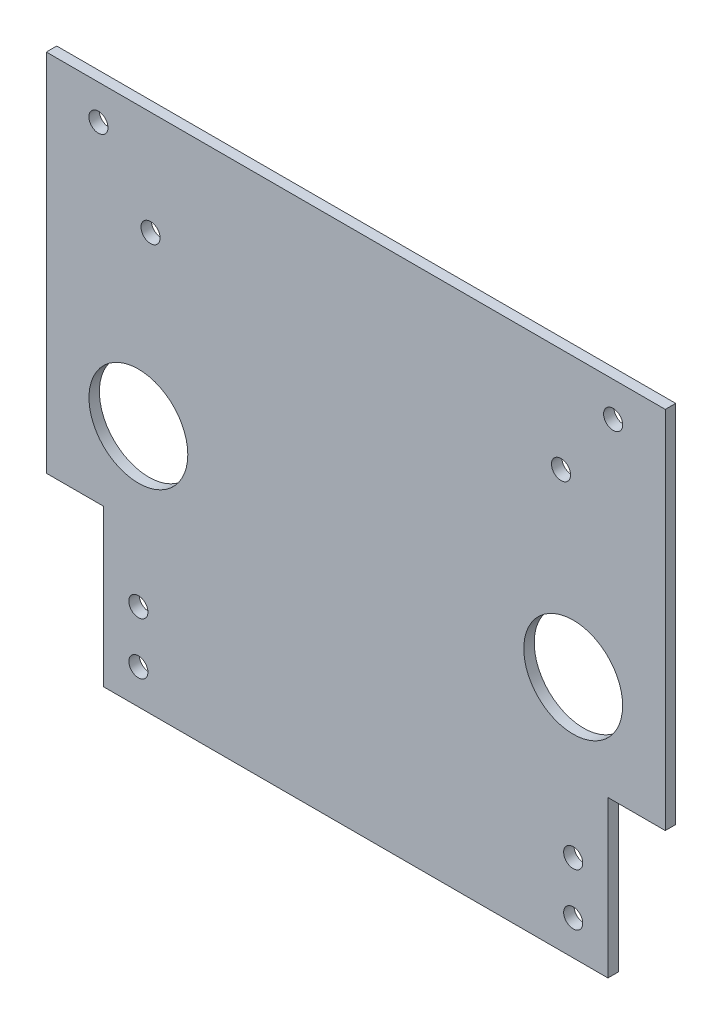
ISO-10303-21;
HEADER;
FILE_DESCRIPTION(('STEP AP214'),'2;1');
FILE_NAME('part.step','',(''),(''),'','','');
FILE_SCHEMA(('AUTOMOTIVE_DESIGN { 1 0 10303 214 1 1 1 1 }'));
ENDSEC;
DATA;
#1=APPLICATION_CONTEXT('core data for automotive mechanical design processes');
#2=APPLICATION_PROTOCOL_DEFINITION('international standard','automotive_design',2000,#1);
#3=PRODUCT_CONTEXT('',#1,'mechanical');
#4=PRODUCT('Part','Part','',(#3));
#5=PRODUCT_RELATED_PRODUCT_CATEGORY('part','',(#4));
#6=PRODUCT_DEFINITION_FORMATION('','',#4);
#7=PRODUCT_DEFINITION_CONTEXT('part definition',#1,'design');
#8=PRODUCT_DEFINITION('design','',#6,#7);
#9=PRODUCT_DEFINITION_SHAPE('','',#8);
#10=(LENGTH_UNIT() NAMED_UNIT(*) SI_UNIT(.MILLI.,.METRE.));
#11=(NAMED_UNIT(*) PLANE_ANGLE_UNIT() SI_UNIT($,.RADIAN.));
#12=(NAMED_UNIT(*) SI_UNIT($,.STERADIAN.) SOLID_ANGLE_UNIT());
#13=UNCERTAINTY_MEASURE_WITH_UNIT(LENGTH_MEASURE(1.E-05),#10,'distance_accuracy_value','');
#14=(GEOMETRIC_REPRESENTATION_CONTEXT(3) GLOBAL_UNCERTAINTY_ASSIGNED_CONTEXT((#13)) GLOBAL_UNIT_ASSIGNED_CONTEXT((#10,
#11,#12)) REPRESENTATION_CONTEXT('',''));
#15=CARTESIAN_POINT('',(0.,0.,0.));
#16=DIRECTION('',(0.,0.,1.));
#17=DIRECTION('',(1.,0.,0.));
#18=AXIS2_PLACEMENT_3D('',#15,#16,#17);
#19=CARTESIAN_POINT('',(0.,-150.,3.));
#20=DIRECTION('',(0.,1.,0.));
#21=DIRECTION('',(0.,0.,1.));
#22=AXIS2_PLACEMENT_3D('',#19,#20,#21);
#23=PLANE('',#22);
#24=DIRECTION('',(0.,0.,1.));
#25=VECTOR('',#24,1.);
#26=CARTESIAN_POINT('',(16.5,-150.,0.));
#27=LINE('',#26,#25);
#28=CARTESIAN_POINT('',(16.5,-150.,0.));
#29=VERTEX_POINT('',#28);
#30=CARTESIAN_POINT('',(16.5,-150.,3.));
#31=VERTEX_POINT('',#30);
#32=EDGE_CURVE('E109',#29,#31,#27,.T.);
#33=ORIENTED_EDGE('',*,*,#32,.F.);
#34=DIRECTION('',(1.,0.,0.));
#35=VECTOR('',#34,1.);
#36=CARTESIAN_POINT('',(0.,-150.,0.));
#37=LINE('',#36,#35);
#38=CARTESIAN_POINT('',(161.66,-150.,0.));
#39=VERTEX_POINT('',#38);
#40=EDGE_CURVE('E121',#29,#39,#37,.T.);
#41=ORIENTED_EDGE('',*,*,#40,.T.);
#42=DIRECTION('',(0.,0.,1.));
#43=VECTOR('',#42,1.);
#44=CARTESIAN_POINT('',(161.66,-150.,0.));
#45=LINE('',#44,#43);
#46=CARTESIAN_POINT('',(161.66,-150.,3.));
#47=VERTEX_POINT('',#46);
#48=EDGE_CURVE('E193',#39,#47,#45,.T.);
#49=ORIENTED_EDGE('',*,*,#48,.T.);
#50=DIRECTION('',(1.,0.,0.));
#51=VECTOR('',#50,1.);
#52=CARTESIAN_POINT('',(0.,-150.,3.));
#53=LINE('',#52,#51);
#54=EDGE_CURVE('E141',#31,#47,#53,.T.);
#55=ORIENTED_EDGE('',*,*,#54,.F.);
#56=EDGE_LOOP('',(#33,#41,#49,#55));
#57=FACE_BOUND('',#56,.T.);
#58=ADVANCED_FACE('F39',(#57),#23,.F.);
#59=CARTESIAN_POINT('',(178.16,0.,3.));
#60=DIRECTION('',(-1.,0.,0.));
#61=DIRECTION('',(0.,-1.,0.));
#62=AXIS2_PLACEMENT_3D('',#59,#60,#61);
#63=PLANE('',#62);
#64=DIRECTION('',(0.,0.,1.));
#65=VECTOR('',#64,1.);
#66=CARTESIAN_POINT('',(178.16,-105.,0.));
#67=LINE('',#66,#65);
#68=CARTESIAN_POINT('',(178.16,-105.,0.));
#69=VERTEX_POINT('',#68);
#70=CARTESIAN_POINT('',(178.16,-105.,3.));
#71=VERTEX_POINT('',#70);
#72=EDGE_CURVE('E186',#69,#71,#67,.T.);
#73=ORIENTED_EDGE('',*,*,#72,.F.);
#74=DIRECTION('',(0.,1.,0.));
#75=VECTOR('',#74,1.);
#76=CARTESIAN_POINT('',(178.16,0.,0.));
#77=LINE('',#76,#75);
#78=CARTESIAN_POINT('',(178.16,0.,0.));
#79=VERTEX_POINT('',#78);
#80=EDGE_CURVE('E130',#69,#79,#77,.T.);
#81=ORIENTED_EDGE('',*,*,#80,.T.);
#82=DIRECTION('',(0.,0.,-1.));
#83=VECTOR('',#82,1.);
#84=CARTESIAN_POINT('',(178.16,0.,3.));
#85=LINE('',#84,#83);
#86=CARTESIAN_POINT('',(178.16,0.,3.));
#87=VERTEX_POINT('',#86);
#88=EDGE_CURVE('E11',#87,#79,#85,.T.);
#89=ORIENTED_EDGE('',*,*,#88,.F.);
#90=DIRECTION('',(0.,1.,0.));
#91=VECTOR('',#90,1.);
#92=CARTESIAN_POINT('',(178.16,0.,3.));
#93=LINE('',#92,#91);
#94=EDGE_CURVE('E137',#71,#87,#93,.T.);
#95=ORIENTED_EDGE('',*,*,#94,.F.);
#96=EDGE_LOOP('',(#73,#81,#89,#95));
#97=FACE_BOUND('',#96,.T.);
#98=ADVANCED_FACE('F282',(#97),#63,.F.);
#99=CARTESIAN_POINT('',(0.,0.,3.));
#100=DIRECTION('',(1.,0.,0.));
#101=DIRECTION('',(0.,1.,0.));
#102=AXIS2_PLACEMENT_3D('',#99,#100,#101);
#103=PLANE('',#102);
#104=DIRECTION('',(0.,-1.,0.));
#105=VECTOR('',#104,1.);
#106=CARTESIAN_POINT('',(0.,0.,0.));
#107=LINE('',#106,#105);
#108=CARTESIAN_POINT('',(0.,0.,0.));
#109=VERTEX_POINT('',#108);
#110=CARTESIAN_POINT('',(0.,-105.,0.));
#111=VERTEX_POINT('',#110);
#112=EDGE_CURVE('E117',#109,#111,#107,.T.);
#113=ORIENTED_EDGE('',*,*,#112,.T.);
#114=DIRECTION('',(0.,0.,1.));
#115=VECTOR('',#114,1.);
#116=CARTESIAN_POINT('',(0.,-105.,0.));
#117=LINE('',#116,#115);
#118=CARTESIAN_POINT('',(0.,-105.,3.));
#119=VERTEX_POINT('',#118);
#120=EDGE_CURVE('E105',#111,#119,#117,.T.);
#121=ORIENTED_EDGE('',*,*,#120,.T.);
#122=DIRECTION('',(0.,-1.,0.));
#123=VECTOR('',#122,1.);
#124=CARTESIAN_POINT('',(0.,0.,3.));
#125=LINE('',#124,#123);
#126=CARTESIAN_POINT('',(0.,0.,3.));
#127=VERTEX_POINT('',#126);
#128=EDGE_CURVE('E139',#127,#119,#125,.T.);
#129=ORIENTED_EDGE('',*,*,#128,.F.);
#130=DIRECTION('',(0.,0.,-1.));
#131=VECTOR('',#130,1.);
#132=CARTESIAN_POINT('',(0.,0.,3.));
#133=LINE('',#132,#131);
#134=EDGE_CURVE('E50',#127,#109,#133,.T.);
#135=ORIENTED_EDGE('',*,*,#134,.T.);
#136=EDGE_LOOP('',(#113,#121,#129,#135));
#137=FACE_BOUND('',#136,.T.);
#138=ADVANCED_FACE('F41',(#137),#103,.F.);
#139=CARTESIAN_POINT('',(0.,0.,3.));
#140=DIRECTION('',(0.,-1.,0.));
#141=DIRECTION('',(0.,0.,-1.));
#142=AXIS2_PLACEMENT_3D('',#139,#140,#141);
#143=PLANE('',#142);
#144=DIRECTION('',(-1.,0.,0.));
#145=VECTOR('',#144,1.);
#146=CARTESIAN_POINT('',(0.,0.,0.));
#147=LINE('',#146,#145);
#148=EDGE_CURVE('E136',#79,#109,#147,.T.);
#149=ORIENTED_EDGE('',*,*,#148,.T.);
#150=ORIENTED_EDGE('',*,*,#134,.F.);
#151=DIRECTION('',(-1.,0.,0.));
#152=VECTOR('',#151,1.);
#153=CARTESIAN_POINT('',(0.,0.,3.));
#154=LINE('',#153,#152);
#155=EDGE_CURVE('E131',#87,#127,#154,.T.);
#156=ORIENTED_EDGE('',*,*,#155,.F.);
#157=ORIENTED_EDGE('',*,*,#88,.T.);
#158=EDGE_LOOP('',(#149,#150,#156,#157));
#159=FACE_BOUND('',#158,.T.);
#160=ADVANCED_FACE('F243',(#159),#143,.F.);
#161=CARTESIAN_POINT('',(0.,0.,3.));
#162=DIRECTION('',(0.,0.,1.));
#163=DIRECTION('',(1.,0.,0.));
#164=AXIS2_PLACEMENT_3D('',#161,#162,#163);
#165=PLANE('',#164);
#166=CARTESIAN_POINT('',(163.16,-9.99999999999999,3.));
#167=DIRECTION('',(0.,0.,1.));
#168=DIRECTION('',(1.,0.,0.));
#169=AXIS2_PLACEMENT_3D('',#166,#167,#168);
#170=CIRCLE('',#169,2.75000000000004);
#171=CARTESIAN_POINT('',(165.91,-9.99999999999999,3.));
#172=VERTEX_POINT('',#171);
#173=EDGE_CURVE('E218',#172,#172,#170,.T.);
#174=ORIENTED_EDGE('',*,*,#173,.F.);
#175=EDGE_LOOP('',(#174));
#176=FACE_BOUND('',#175,.T.);
#177=CARTESIAN_POINT('',(30.,-30.,3.));
#178=DIRECTION('',(0.,0.,1.));
#179=DIRECTION('',(1.,0.,0.));
#180=AXIS2_PLACEMENT_3D('',#177,#178,#179);
#181=CIRCLE('',#180,2.75);
#182=CARTESIAN_POINT('',(32.75,-30.,3.));
#183=VERTEX_POINT('',#182);
#184=EDGE_CURVE('E214',#183,#183,#181,.T.);
#185=ORIENTED_EDGE('',*,*,#184,.F.);
#186=EDGE_LOOP('',(#185));
#187=FACE_BOUND('',#186,.T.);
#188=CARTESIAN_POINT('',(148.16,-30.,3.));
#189=DIRECTION('',(0.,0.,1.));
#190=DIRECTION('',(1.,0.,0.));
#191=AXIS2_PLACEMENT_3D('',#188,#189,#190);
#192=CIRCLE('',#191,2.75000000000001);
#193=CARTESIAN_POINT('',(150.91,-30.,3.));
#194=VERTEX_POINT('',#193);
#195=EDGE_CURVE('E208',#194,#194,#192,.T.);
#196=ORIENTED_EDGE('',*,*,#195,.F.);
#197=EDGE_LOOP('',(#196));
#198=FACE_BOUND('',#197,.T.);
#199=CARTESIAN_POINT('',(15.,-10.,3.));
#200=DIRECTION('',(0.,0.,1.));
#201=DIRECTION('',(1.,0.,0.));
#202=AXIS2_PLACEMENT_3D('',#199,#200,#201);
#203=CIRCLE('',#202,2.75);
#204=CARTESIAN_POINT('',(17.75,-10.,3.));
#205=VERTEX_POINT('',#204);
#206=EDGE_CURVE('E219',#205,#205,#203,.T.);
#207=ORIENTED_EDGE('',*,*,#206,.F.);
#208=EDGE_LOOP('',(#207));
#209=FACE_BOUND('',#208,.T.);
#210=DIRECTION('',(-1.,0.,0.));
#211=VECTOR('',#210,1.);
#212=CARTESIAN_POINT('',(16.5,-105.,3.));
#213=LINE('',#212,#211);
#214=CARTESIAN_POINT('',(16.5,-105.,3.));
#215=VERTEX_POINT('',#214);
#216=EDGE_CURVE('E102',#215,#119,#213,.T.);
#217=ORIENTED_EDGE('',*,*,#216,.F.);
#218=DIRECTION('',(0.,1.,0.));
#219=VECTOR('',#218,1.);
#220=CARTESIAN_POINT('',(16.5,-150.,3.));
#221=LINE('',#220,#219);
#222=EDGE_CURVE('E119',#31,#215,#221,.T.);
#223=ORIENTED_EDGE('',*,*,#222,.F.);
#224=ORIENTED_EDGE('',*,*,#54,.T.);
#225=DIRECTION('',(0.,-1.,0.));
#226=VECTOR('',#225,1.);
#227=CARTESIAN_POINT('',(161.66,-150.,3.));
#228=LINE('',#227,#226);
#229=CARTESIAN_POINT('',(161.66,-105.,3.));
#230=VERTEX_POINT('',#229);
#231=EDGE_CURVE('E190',#230,#47,#228,.T.);
#232=ORIENTED_EDGE('',*,*,#231,.F.);
#233=DIRECTION('',(-1.,0.,0.));
#234=VECTOR('',#233,1.);
#235=CARTESIAN_POINT('',(178.16,-105.,3.));
#236=LINE('',#235,#234);
#237=EDGE_CURVE('E188',#71,#230,#236,.T.);
#238=ORIENTED_EDGE('',*,*,#237,.F.);
#239=ORIENTED_EDGE('',*,*,#94,.T.);
#240=ORIENTED_EDGE('',*,*,#155,.T.);
#241=ORIENTED_EDGE('',*,*,#128,.T.);
#242=EDGE_LOOP('',(#217,#223,#224,#232,#238,#239,#240,#241));
#243=FACE_BOUND('',#242,.T.);
#244=CARTESIAN_POINT('',(26.5,-125.,3.));
#245=DIRECTION('',(0.,0.,1.));
#246=DIRECTION('',(1.,0.,0.));
#247=AXIS2_PLACEMENT_3D('',#244,#245,#246);
#248=CIRCLE('',#247,2.75);
#249=CARTESIAN_POINT('',(29.25,-125.,3.));
#250=VERTEX_POINT('',#249);
#251=EDGE_CURVE('E169',#250,#250,#248,.T.);
#252=ORIENTED_EDGE('',*,*,#251,.F.);
#253=EDGE_LOOP('',(#252));
#254=FACE_BOUND('',#253,.T.);
#255=CARTESIAN_POINT('',(151.66,-140.,3.));
#256=DIRECTION('',(0.,0.,1.));
#257=DIRECTION('',(1.,0.,0.));
#258=AXIS2_PLACEMENT_3D('',#255,#256,#257);
#259=CIRCLE('',#258,2.75000000000001);
#260=CARTESIAN_POINT('',(154.41,-140.,3.));
#261=VERTEX_POINT('',#260);
#262=EDGE_CURVE('E156',#261,#261,#259,.T.);
#263=ORIENTED_EDGE('',*,*,#262,.F.);
#264=EDGE_LOOP('',(#263));
#265=FACE_BOUND('',#264,.T.);
#266=CARTESIAN_POINT('',(26.5,-140.,3.));
#267=DIRECTION('',(0.,0.,1.));
#268=DIRECTION('',(1.,0.,0.));
#269=AXIS2_PLACEMENT_3D('',#266,#267,#268);
#270=CIRCLE('',#269,2.75);
#271=CARTESIAN_POINT('',(29.25,-140.,3.));
#272=VERTEX_POINT('',#271);
#273=EDGE_CURVE('E160',#272,#272,#270,.T.);
#274=ORIENTED_EDGE('',*,*,#273,.F.);
#275=EDGE_LOOP('',(#274));
#276=FACE_BOUND('',#275,.T.);
#277=CARTESIAN_POINT('',(151.66,-80.,3.));
#278=DIRECTION('',(0.,0.,1.));
#279=DIRECTION('',(1.,0.,0.));
#280=AXIS2_PLACEMENT_3D('',#277,#278,#279);
#281=CIRCLE('',#280,14.225);
#282=CARTESIAN_POINT('',(165.885,-80.,3.));
#283=VERTEX_POINT('',#282);
#284=EDGE_CURVE('E154',#283,#283,#281,.T.);
#285=ORIENTED_EDGE('',*,*,#284,.F.);
#286=EDGE_LOOP('',(#285));
#287=FACE_BOUND('',#286,.T.);
#288=CARTESIAN_POINT('',(151.66,-125.,3.));
#289=DIRECTION('',(0.,0.,1.));
#290=DIRECTION('',(1.,0.,0.));
#291=AXIS2_PLACEMENT_3D('',#288,#289,#290);
#292=CIRCLE('',#291,2.75000000000001);
#293=CARTESIAN_POINT('',(154.41,-125.,3.));
#294=VERTEX_POINT('',#293);
#295=EDGE_CURVE('E167',#294,#294,#292,.T.);
#296=ORIENTED_EDGE('',*,*,#295,.F.);
#297=EDGE_LOOP('',(#296));
#298=FACE_BOUND('',#297,.T.);
#299=CARTESIAN_POINT('',(26.5,-80.,3.));
#300=DIRECTION('',(0.,0.,1.));
#301=DIRECTION('',(1.,0.,0.));
#302=AXIS2_PLACEMENT_3D('',#299,#300,#301);
#303=CIRCLE('',#302,14.225);
#304=CARTESIAN_POINT('',(40.725,-80.,3.));
#305=VERTEX_POINT('',#304);
#306=EDGE_CURVE('E132',#305,#305,#303,.T.);
#307=ORIENTED_EDGE('',*,*,#306,.F.);
#308=EDGE_LOOP('',(#307));
#309=FACE_BOUND('',#308,.T.);
#310=ADVANCED_FACE('F239',(#176,#187,#198,#209,#243,#254,#265,#276,#287,#298,#309),#165,.T.);
#311=CARTESIAN_POINT('',(0.,0.,0.));
#312=DIRECTION('',(0.,0.,1.));
#313=DIRECTION('',(1.,0.,0.));
#314=AXIS2_PLACEMENT_3D('',#311,#312,#313);
#315=PLANE('',#314);
#316=CARTESIAN_POINT('',(163.16,-9.99999999999999,0.));
#317=DIRECTION('',(0.,0.,1.));
#318=DIRECTION('',(1.,0.,0.));
#319=AXIS2_PLACEMENT_3D('',#316,#317,#318);
#320=CIRCLE('',#319,2.75000000000004);
#321=CARTESIAN_POINT('',(165.91,-9.99999999999999,0.));
#322=VERTEX_POINT('',#321);
#323=EDGE_CURVE('E200',#322,#322,#320,.T.);
#324=ORIENTED_EDGE('',*,*,#323,.T.);
#325=EDGE_LOOP('',(#324));
#326=FACE_BOUND('',#325,.T.);
#327=CARTESIAN_POINT('',(30.,-30.,0.));
#328=DIRECTION('',(0.,0.,1.));
#329=DIRECTION('',(1.,0.,0.));
#330=AXIS2_PLACEMENT_3D('',#327,#328,#329);
#331=CIRCLE('',#330,2.75);
#332=CARTESIAN_POINT('',(32.75,-30.,0.));
#333=VERTEX_POINT('',#332);
#334=EDGE_CURVE('E223',#333,#333,#331,.T.);
#335=ORIENTED_EDGE('',*,*,#334,.T.);
#336=EDGE_LOOP('',(#335));
#337=FACE_BOUND('',#336,.T.);
#338=CARTESIAN_POINT('',(148.16,-30.,0.));
#339=DIRECTION('',(0.,0.,1.));
#340=DIRECTION('',(1.,0.,0.));
#341=AXIS2_PLACEMENT_3D('',#338,#339,#340);
#342=CIRCLE('',#341,2.75000000000001);
#343=CARTESIAN_POINT('',(150.91,-30.,0.));
#344=VERTEX_POINT('',#343);
#345=EDGE_CURVE('E210',#344,#344,#342,.T.);
#346=ORIENTED_EDGE('',*,*,#345,.T.);
#347=EDGE_LOOP('',(#346));
#348=FACE_BOUND('',#347,.T.);
#349=CARTESIAN_POINT('',(15.,-10.,0.));
#350=DIRECTION('',(0.,0.,1.));
#351=DIRECTION('',(1.,0.,0.));
#352=AXIS2_PLACEMENT_3D('',#349,#350,#351);
#353=CIRCLE('',#352,2.75);
#354=CARTESIAN_POINT('',(17.75,-10.,0.));
#355=VERTEX_POINT('',#354);
#356=EDGE_CURVE('E213',#355,#355,#353,.T.);
#357=ORIENTED_EDGE('',*,*,#356,.T.);
#358=EDGE_LOOP('',(#357));
#359=FACE_BOUND('',#358,.T.);
#360=CARTESIAN_POINT('',(26.5,-125.,0.));
#361=DIRECTION('',(0.,0.,1.));
#362=DIRECTION('',(1.,0.,0.));
#363=AXIS2_PLACEMENT_3D('',#360,#361,#362);
#364=CIRCLE('',#363,2.75);
#365=CARTESIAN_POINT('',(29.25,-125.,0.));
#366=VERTEX_POINT('',#365);
#367=EDGE_CURVE('E168',#366,#366,#364,.T.);
#368=ORIENTED_EDGE('',*,*,#367,.T.);
#369=EDGE_LOOP('',(#368));
#370=FACE_BOUND('',#369,.T.);
#371=CARTESIAN_POINT('',(151.66,-140.,0.));
#372=DIRECTION('',(0.,0.,1.));
#373=DIRECTION('',(1.,0.,0.));
#374=AXIS2_PLACEMENT_3D('',#371,#372,#373);
#375=CIRCLE('',#374,2.75000000000001);
#376=CARTESIAN_POINT('',(154.41,-140.,0.));
#377=VERTEX_POINT('',#376);
#378=EDGE_CURVE('E173',#377,#377,#375,.T.);
#379=ORIENTED_EDGE('',*,*,#378,.T.);
#380=EDGE_LOOP('',(#379));
#381=FACE_BOUND('',#380,.T.);
#382=CARTESIAN_POINT('',(26.5,-140.,0.));
#383=DIRECTION('',(0.,0.,1.));
#384=DIRECTION('',(1.,0.,0.));
#385=AXIS2_PLACEMENT_3D('',#382,#383,#384);
#386=CIRCLE('',#385,2.75);
#387=CARTESIAN_POINT('',(29.25,-140.,0.));
#388=VERTEX_POINT('',#387);
#389=EDGE_CURVE('E151',#388,#388,#386,.T.);
#390=ORIENTED_EDGE('',*,*,#389,.T.);
#391=EDGE_LOOP('',(#390));
#392=FACE_BOUND('',#391,.T.);
#393=CARTESIAN_POINT('',(151.66,-80.,0.));
#394=DIRECTION('',(0.,0.,1.));
#395=DIRECTION('',(1.,0.,0.));
#396=AXIS2_PLACEMENT_3D('',#393,#394,#395);
#397=CIRCLE('',#396,14.225);
#398=CARTESIAN_POINT('',(165.885,-80.,0.));
#399=VERTEX_POINT('',#398);
#400=EDGE_CURVE('E163',#399,#399,#397,.T.);
#401=ORIENTED_EDGE('',*,*,#400,.T.);
#402=EDGE_LOOP('',(#401));
#403=FACE_BOUND('',#402,.T.);
#404=CARTESIAN_POINT('',(151.66,-125.,0.));
#405=DIRECTION('',(0.,0.,1.));
#406=DIRECTION('',(1.,0.,0.));
#407=AXIS2_PLACEMENT_3D('',#404,#405,#406);
#408=CIRCLE('',#407,2.75000000000001);
#409=CARTESIAN_POINT('',(154.41,-125.,0.));
#410=VERTEX_POINT('',#409);
#411=EDGE_CURVE('E178',#410,#410,#408,.T.);
#412=ORIENTED_EDGE('',*,*,#411,.T.);
#413=EDGE_LOOP('',(#412));
#414=FACE_BOUND('',#413,.T.);
#415=CARTESIAN_POINT('',(26.5,-80.,0.));
#416=DIRECTION('',(0.,0.,1.));
#417=DIRECTION('',(1.,0.,0.));
#418=AXIS2_PLACEMENT_3D('',#415,#416,#417);
#419=CIRCLE('',#418,14.225);
#420=CARTESIAN_POINT('',(40.725,-80.,0.));
#421=VERTEX_POINT('',#420);
#422=EDGE_CURVE('E123',#421,#421,#419,.T.);
#423=ORIENTED_EDGE('',*,*,#422,.T.);
#424=EDGE_LOOP('',(#423));
#425=FACE_BOUND('',#424,.T.);
#426=DIRECTION('',(0.,1.,0.));
#427=VECTOR('',#426,1.);
#428=CARTESIAN_POINT('',(16.5,-150.,0.));
#429=LINE('',#428,#427);
#430=CARTESIAN_POINT('',(16.5,-105.,0.));
#431=VERTEX_POINT('',#430);
#432=EDGE_CURVE('E111',#29,#431,#429,.T.);
#433=ORIENTED_EDGE('',*,*,#432,.T.);
#434=DIRECTION('',(-1.,0.,0.));
#435=VECTOR('',#434,1.);
#436=CARTESIAN_POINT('',(16.5,-105.,0.));
#437=LINE('',#436,#435);
#438=EDGE_CURVE('E53',#431,#111,#437,.T.);
#439=ORIENTED_EDGE('',*,*,#438,.T.);
#440=ORIENTED_EDGE('',*,*,#112,.F.);
#441=ORIENTED_EDGE('',*,*,#148,.F.);
#442=ORIENTED_EDGE('',*,*,#80,.F.);
#443=DIRECTION('',(-1.,0.,0.));
#444=VECTOR('',#443,1.);
#445=CARTESIAN_POINT('',(178.16,-105.,0.));
#446=LINE('',#445,#444);
#447=CARTESIAN_POINT('',(161.66,-105.,0.));
#448=VERTEX_POINT('',#447);
#449=EDGE_CURVE('E183',#69,#448,#446,.T.);
#450=ORIENTED_EDGE('',*,*,#449,.T.);
#451=DIRECTION('',(0.,-1.,0.));
#452=VECTOR('',#451,1.);
#453=CARTESIAN_POINT('',(161.66,-150.,0.));
#454=LINE('',#453,#452);
#455=EDGE_CURVE('E61',#448,#39,#454,.T.);
#456=ORIENTED_EDGE('',*,*,#455,.T.);
#457=ORIENTED_EDGE('',*,*,#40,.F.);
#458=EDGE_LOOP('',(#433,#439,#440,#441,#442,#450,#456,#457));
#459=FACE_BOUND('',#458,.T.);
#460=ADVANCED_FACE('F116',(#326,#337,#348,#359,#370,#381,#392,#403,#414,#425,#459),#315,.F.);
#461=CARTESIAN_POINT('',(26.5,-80.,0.));
#462=DIRECTION('',(0.,0.,1.));
#463=DIRECTION('',(1.,0.,0.));
#464=AXIS2_PLACEMENT_3D('',#461,#462,#463);
#465=CYLINDRICAL_SURFACE('',#464,14.225);
#466=ORIENTED_EDGE('',*,*,#422,.F.);
#467=EDGE_LOOP('',(#466));
#468=FACE_BOUND('',#467,.T.);
#469=ORIENTED_EDGE('',*,*,#306,.T.);
#470=EDGE_LOOP('',(#469));
#471=FACE_BOUND('',#470,.T.);
#472=ADVANCED_FACE('F261',(#468,#471),#465,.F.);
#473=CARTESIAN_POINT('',(151.66,-125.,0.));
#474=DIRECTION('',(0.,0.,1.));
#475=DIRECTION('',(1.,0.,0.));
#476=AXIS2_PLACEMENT_3D('',#473,#474,#475);
#477=CYLINDRICAL_SURFACE('',#476,2.75000000000001);
#478=ORIENTED_EDGE('',*,*,#411,.F.);
#479=EDGE_LOOP('',(#478));
#480=FACE_BOUND('',#479,.T.);
#481=ORIENTED_EDGE('',*,*,#295,.T.);
#482=EDGE_LOOP('',(#481));
#483=FACE_BOUND('',#482,.T.);
#484=ADVANCED_FACE('F268',(#480,#483),#477,.F.);
#485=CARTESIAN_POINT('',(151.66,-80.,0.));
#486=DIRECTION('',(0.,0.,1.));
#487=DIRECTION('',(1.,0.,0.));
#488=AXIS2_PLACEMENT_3D('',#485,#486,#487);
#489=CYLINDRICAL_SURFACE('',#488,14.225);
#490=ORIENTED_EDGE('',*,*,#400,.F.);
#491=EDGE_LOOP('',(#490));
#492=FACE_BOUND('',#491,.T.);
#493=ORIENTED_EDGE('',*,*,#284,.T.);
#494=EDGE_LOOP('',(#493));
#495=FACE_BOUND('',#494,.T.);
#496=ADVANCED_FACE('F271',(#492,#495),#489,.F.);
#497=CARTESIAN_POINT('',(26.5,-140.,0.));
#498=DIRECTION('',(0.,0.,1.));
#499=DIRECTION('',(1.,0.,0.));
#500=AXIS2_PLACEMENT_3D('',#497,#498,#499);
#501=CYLINDRICAL_SURFACE('',#500,2.75);
#502=ORIENTED_EDGE('',*,*,#389,.F.);
#503=EDGE_LOOP('',(#502));
#504=FACE_BOUND('',#503,.T.);
#505=ORIENTED_EDGE('',*,*,#273,.T.);
#506=EDGE_LOOP('',(#505));
#507=FACE_BOUND('',#506,.T.);
#508=ADVANCED_FACE('F322',(#504,#507),#501,.F.);
#509=CARTESIAN_POINT('',(151.66,-140.,0.));
#510=DIRECTION('',(0.,0.,1.));
#511=DIRECTION('',(1.,0.,0.));
#512=AXIS2_PLACEMENT_3D('',#509,#510,#511);
#513=CYLINDRICAL_SURFACE('',#512,2.75000000000001);
#514=ORIENTED_EDGE('',*,*,#378,.F.);
#515=EDGE_LOOP('',(#514));
#516=FACE_BOUND('',#515,.T.);
#517=ORIENTED_EDGE('',*,*,#262,.T.);
#518=EDGE_LOOP('',(#517));
#519=FACE_BOUND('',#518,.T.);
#520=ADVANCED_FACE('F321',(#516,#519),#513,.F.);
#521=CARTESIAN_POINT('',(26.5,-125.,0.));
#522=DIRECTION('',(0.,0.,1.));
#523=DIRECTION('',(1.,0.,0.));
#524=AXIS2_PLACEMENT_3D('',#521,#522,#523);
#525=CYLINDRICAL_SURFACE('',#524,2.75);
#526=ORIENTED_EDGE('',*,*,#367,.F.);
#527=EDGE_LOOP('',(#526));
#528=FACE_BOUND('',#527,.T.);
#529=ORIENTED_EDGE('',*,*,#251,.T.);
#530=EDGE_LOOP('',(#529));
#531=FACE_BOUND('',#530,.T.);
#532=ADVANCED_FACE('F318',(#528,#531),#525,.F.);
#533=CARTESIAN_POINT('',(161.66,-150.,0.));
#534=DIRECTION('',(-1.,0.,0.));
#535=DIRECTION('',(0.,0.,1.));
#536=AXIS2_PLACEMENT_3D('',#533,#534,#535);
#537=PLANE('',#536);
#538=ORIENTED_EDGE('',*,*,#231,.T.);
#539=ORIENTED_EDGE('',*,*,#48,.F.);
#540=ORIENTED_EDGE('',*,*,#455,.F.);
#541=DIRECTION('',(0.,0.,1.));
#542=VECTOR('',#541,1.);
#543=CARTESIAN_POINT('',(161.66,-105.,0.));
#544=LINE('',#543,#542);
#545=EDGE_CURVE('E199',#448,#230,#544,.T.);
#546=ORIENTED_EDGE('',*,*,#545,.T.);
#547=EDGE_LOOP('',(#538,#539,#540,#546));
#548=FACE_BOUND('',#547,.T.);
#549=ADVANCED_FACE('F301',(#548),#537,.F.);
#550=CARTESIAN_POINT('',(178.16,-105.,0.));
#551=DIRECTION('',(0.,1.,0.));
#552=DIRECTION('',(0.,0.,1.));
#553=AXIS2_PLACEMENT_3D('',#550,#551,#552);
#554=PLANE('',#553);
#555=ORIENTED_EDGE('',*,*,#237,.T.);
#556=ORIENTED_EDGE('',*,*,#545,.F.);
#557=ORIENTED_EDGE('',*,*,#449,.F.);
#558=ORIENTED_EDGE('',*,*,#72,.T.);
#559=EDGE_LOOP('',(#555,#556,#557,#558));
#560=FACE_BOUND('',#559,.T.);
#561=ADVANCED_FACE('F296',(#560),#554,.F.);
#562=CARTESIAN_POINT('',(16.5,-105.,0.));
#563=DIRECTION('',(0.,1.,0.));
#564=DIRECTION('',(0.,0.,1.));
#565=AXIS2_PLACEMENT_3D('',#562,#563,#564);
#566=PLANE('',#565);
#567=ORIENTED_EDGE('',*,*,#216,.T.);
#568=ORIENTED_EDGE('',*,*,#120,.F.);
#569=ORIENTED_EDGE('',*,*,#438,.F.);
#570=DIRECTION('',(0.,0.,1.));
#571=VECTOR('',#570,1.);
#572=CARTESIAN_POINT('',(16.5,-105.,0.));
#573=LINE('',#572,#571);
#574=EDGE_CURVE('E181',#431,#215,#573,.T.);
#575=ORIENTED_EDGE('',*,*,#574,.T.);
#576=EDGE_LOOP('',(#567,#568,#569,#575));
#577=FACE_BOUND('',#576,.T.);
#578=ADVANCED_FACE('F101',(#577),#566,.F.);
#579=CARTESIAN_POINT('',(16.5,-150.,0.));
#580=DIRECTION('',(1.,0.,0.));
#581=DIRECTION('',(0.,0.,-1.));
#582=AXIS2_PLACEMENT_3D('',#579,#580,#581);
#583=PLANE('',#582);
#584=ORIENTED_EDGE('',*,*,#222,.T.);
#585=ORIENTED_EDGE('',*,*,#574,.F.);
#586=ORIENTED_EDGE('',*,*,#432,.F.);
#587=ORIENTED_EDGE('',*,*,#32,.T.);
#588=EDGE_LOOP('',(#584,#585,#586,#587));
#589=FACE_BOUND('',#588,.T.);
#590=ADVANCED_FACE('F303',(#589),#583,.F.);
#591=CARTESIAN_POINT('',(15.,-10.,0.));
#592=DIRECTION('',(0.,0.,1.));
#593=DIRECTION('',(1.,0.,0.));
#594=AXIS2_PLACEMENT_3D('',#591,#592,#593);
#595=CYLINDRICAL_SURFACE('',#594,2.75);
#596=ORIENTED_EDGE('',*,*,#356,.F.);
#597=EDGE_LOOP('',(#596));
#598=FACE_BOUND('',#597,.T.);
#599=ORIENTED_EDGE('',*,*,#206,.T.);
#600=EDGE_LOOP('',(#599));
#601=FACE_BOUND('',#600,.T.);
#602=ADVANCED_FACE('F304',(#598,#601),#595,.F.);
#603=CARTESIAN_POINT('',(148.16,-30.,0.));
#604=DIRECTION('',(0.,0.,1.));
#605=DIRECTION('',(1.,0.,0.));
#606=AXIS2_PLACEMENT_3D('',#603,#604,#605);
#607=CYLINDRICAL_SURFACE('',#606,2.75000000000001);
#608=ORIENTED_EDGE('',*,*,#345,.F.);
#609=EDGE_LOOP('',(#608));
#610=FACE_BOUND('',#609,.T.);
#611=ORIENTED_EDGE('',*,*,#195,.T.);
#612=EDGE_LOOP('',(#611));
#613=FACE_BOUND('',#612,.T.);
#614=ADVANCED_FACE('F311',(#610,#613),#607,.F.);
#615=CARTESIAN_POINT('',(30.,-30.,0.));
#616=DIRECTION('',(0.,0.,1.));
#617=DIRECTION('',(1.,0.,0.));
#618=AXIS2_PLACEMENT_3D('',#615,#616,#617);
#619=CYLINDRICAL_SURFACE('',#618,2.75);
#620=ORIENTED_EDGE('',*,*,#334,.F.);
#621=EDGE_LOOP('',(#620));
#622=FACE_BOUND('',#621,.T.);
#623=ORIENTED_EDGE('',*,*,#184,.T.);
#624=EDGE_LOOP('',(#623));
#625=FACE_BOUND('',#624,.T.);
#626=ADVANCED_FACE('F236',(#622,#625),#619,.F.);
#627=CARTESIAN_POINT('',(163.16,-9.99999999999999,0.));
#628=DIRECTION('',(0.,0.,1.));
#629=DIRECTION('',(1.,0.,0.));
#630=AXIS2_PLACEMENT_3D('',#627,#628,#629);
#631=CYLINDRICAL_SURFACE('',#630,2.75000000000004);
#632=ORIENTED_EDGE('',*,*,#323,.F.);
#633=EDGE_LOOP('',(#632));
#634=FACE_BOUND('',#633,.T.);
#635=ORIENTED_EDGE('',*,*,#173,.T.);
#636=EDGE_LOOP('',(#635));
#637=FACE_BOUND('',#636,.T.);
#638=ADVANCED_FACE('F231',(#634,#637),#631,.F.);
#639=CLOSED_SHELL('',(#58,#98,#138,#160,#310,#460,#472,#484,#496,#508,#520,#532,#549,#561,#578,
#590,#602,#614,#626,#638));
#640=MANIFOLD_SOLID_BREP('B2',#639);
#641=ADVANCED_BREP_SHAPE_REPRESENTATION('',(#18,#640),#14);
#642=SHAPE_DEFINITION_REPRESENTATION(#9,#641);
ENDSEC;
END-ISO-10303-21;
